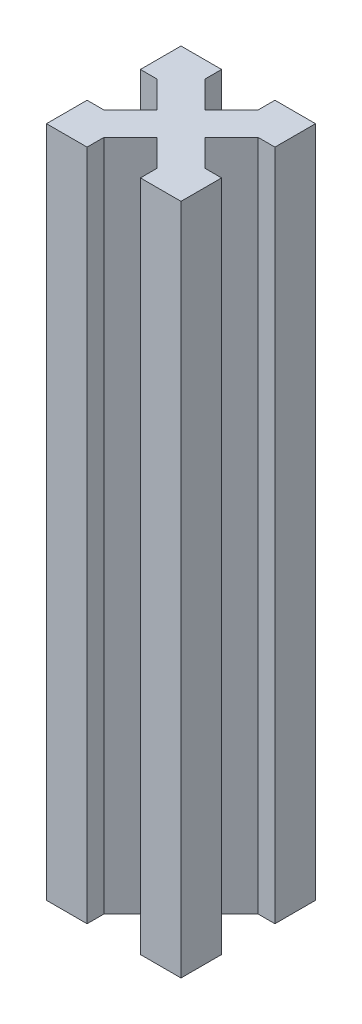
ISO-10303-21;
HEADER;
FILE_DESCRIPTION(('STEP AP214'),'2;1');
FILE_NAME('part.step','',(''),(''),'','','');
FILE_SCHEMA(('AUTOMOTIVE_DESIGN { 1 0 10303 214 1 1 1 1 }'));
ENDSEC;
DATA;
#1=APPLICATION_CONTEXT('core data for automotive mechanical design processes');
#2=APPLICATION_PROTOCOL_DEFINITION('international standard','automotive_design',2000,#1);
#3=PRODUCT_CONTEXT('',#1,'mechanical');
#4=PRODUCT('Part','Part','',(#3));
#5=PRODUCT_RELATED_PRODUCT_CATEGORY('part','',(#4));
#6=PRODUCT_DEFINITION_FORMATION('','',#4);
#7=PRODUCT_DEFINITION_CONTEXT('part definition',#1,'design');
#8=PRODUCT_DEFINITION('design','',#6,#7);
#9=PRODUCT_DEFINITION_SHAPE('','',#8);
#10=(LENGTH_UNIT() NAMED_UNIT(*) SI_UNIT(.MILLI.,.METRE.));
#11=(NAMED_UNIT(*) PLANE_ANGLE_UNIT() SI_UNIT($,.RADIAN.));
#12=(NAMED_UNIT(*) SI_UNIT($,.STERADIAN.) SOLID_ANGLE_UNIT());
#13=UNCERTAINTY_MEASURE_WITH_UNIT(LENGTH_MEASURE(1.E-05),#10,'distance_accuracy_value','');
#14=(GEOMETRIC_REPRESENTATION_CONTEXT(3) GLOBAL_UNCERTAINTY_ASSIGNED_CONTEXT((#13)) GLOBAL_UNIT_ASSIGNED_CONTEXT((#10,
#11,#12)) REPRESENTATION_CONTEXT('',''));
#15=CARTESIAN_POINT('',(0.,0.,0.));
#16=DIRECTION('',(0.,0.,1.));
#17=DIRECTION('',(1.,0.,0.));
#18=AXIS2_PLACEMENT_3D('',#15,#16,#17);
#19=CARTESIAN_POINT('',(-11.7677669529664,100.,-11.7677669529664));
#20=DIRECTION('',(0.707106781186548,0.,0.707106781186547));
#21=DIRECTION('',(0.707106781186547,0.,-0.707106781186548));
#22=AXIS2_PLACEMENT_3D('',#19,#20,#21);
#23=PLANE('',#22);
#24=DIRECTION('',(-0.707106781186547,0.,0.707106781186548));
#25=VECTOR('',#24,1.);
#26=CARTESIAN_POINT('',(-11.7677669529664,0.,-11.7677669529664));
#27=LINE('',#26,#25);
#28=CARTESIAN_POINT('',(-13.5355339059327,0.,-10.));
#29=VERTEX_POINT('',#28);
#30=CARTESIAN_POINT('',(-17.5,0.,-6.03553390593274));
#31=VERTEX_POINT('',#30);
#32=EDGE_CURVE('E228',#29,#31,#27,.T.);
#33=ORIENTED_EDGE('',*,*,#32,.T.);
#34=DIRECTION('',(0.,-1.,0.));
#35=VECTOR('',#34,1.);
#36=CARTESIAN_POINT('',(-17.5,100.,-6.03553390593274));
#37=LINE('',#36,#35);
#38=CARTESIAN_POINT('',(-17.5,100.,-6.03553390593274));
#39=VERTEX_POINT('',#38);
#40=EDGE_CURVE('E11',#39,#31,#37,.T.);
#41=ORIENTED_EDGE('',*,*,#40,.F.);
#42=DIRECTION('',(-0.707106781186547,0.,0.707106781186548));
#43=VECTOR('',#42,1.);
#44=CARTESIAN_POINT('',(-11.7677669529664,100.,-11.7677669529664));
#45=LINE('',#44,#43);
#46=CARTESIAN_POINT('',(-13.5355339059327,100.,-10.));
#47=VERTEX_POINT('',#46);
#48=EDGE_CURVE('E291',#47,#39,#45,.T.);
#49=ORIENTED_EDGE('',*,*,#48,.F.);
#50=DIRECTION('',(0.,-1.,0.));
#51=VECTOR('',#50,1.);
#52=CARTESIAN_POINT('',(-13.5355339059327,100.,-10.));
#53=LINE('',#52,#51);
#54=EDGE_CURVE('E224',#47,#29,#53,.T.);
#55=ORIENTED_EDGE('',*,*,#54,.T.);
#56=EDGE_LOOP('',(#33,#41,#49,#55));
#57=FACE_BOUND('',#56,.T.);
#58=ADVANCED_FACE('F38',(#57),#23,.F.);
#59=CARTESIAN_POINT('',(0.,100.,-6.03553390593273));
#60=DIRECTION('',(0.,0.,1.));
#61=DIRECTION('',(1.,0.,0.));
#62=AXIS2_PLACEMENT_3D('',#59,#60,#61);
#63=PLANE('',#62);
#64=DIRECTION('',(-1.,0.,0.));
#65=VECTOR('',#64,1.);
#66=CARTESIAN_POINT('',(0.,0.,-6.03553390593273));
#67=LINE('',#66,#65);
#68=CARTESIAN_POINT('',(-20.,0.,-6.03553390593273));
#69=VERTEX_POINT('',#68);
#70=EDGE_CURVE('E231',#31,#69,#67,.T.);
#71=ORIENTED_EDGE('',*,*,#70,.T.);
#72=DIRECTION('',(0.,-1.,0.));
#73=VECTOR('',#72,1.);
#74=CARTESIAN_POINT('',(-20.,100.,-6.03553390593273));
#75=LINE('',#74,#73);
#76=CARTESIAN_POINT('',(-20.,100.,-6.03553390593273));
#77=VERTEX_POINT('',#76);
#78=EDGE_CURVE('E46',#77,#69,#75,.T.);
#79=ORIENTED_EDGE('',*,*,#78,.F.);
#80=DIRECTION('',(-1.,0.,0.));
#81=VECTOR('',#80,1.);
#82=CARTESIAN_POINT('',(0.,100.,-6.03553390593273));
#83=LINE('',#82,#81);
#84=EDGE_CURVE('E141',#39,#77,#83,.T.);
#85=ORIENTED_EDGE('',*,*,#84,.F.);
#86=ORIENTED_EDGE('',*,*,#40,.T.);
#87=EDGE_LOOP('',(#71,#79,#85,#86));
#88=FACE_BOUND('',#87,.T.);
#89=ADVANCED_FACE('F340',(#88),#63,.F.);
#90=CARTESIAN_POINT('',(-20.,100.,0.));
#91=DIRECTION('',(-1.,0.,0.));
#92=DIRECTION('',(0.,0.,1.));
#93=AXIS2_PLACEMENT_3D('',#90,#91,#92);
#94=PLANE('',#93);
#95=DIRECTION('',(0.,0.,-1.));
#96=VECTOR('',#95,1.);
#97=CARTESIAN_POINT('',(-20.,0.,0.));
#98=LINE('',#97,#96);
#99=CARTESIAN_POINT('',(-20.,0.,0.));
#100=VERTEX_POINT('',#99);
#101=EDGE_CURVE('E234',#100,#69,#98,.T.);
#102=ORIENTED_EDGE('',*,*,#101,.F.);
#103=DIRECTION('',(0.,-1.,0.));
#104=VECTOR('',#103,1.);
#105=CARTESIAN_POINT('',(-20.,100.,0.));
#106=LINE('',#105,#104);
#107=CARTESIAN_POINT('',(-20.,100.,0.));
#108=VERTEX_POINT('',#107);
#109=EDGE_CURVE('E333',#108,#100,#106,.T.);
#110=ORIENTED_EDGE('',*,*,#109,.F.);
#111=DIRECTION('',(0.,0.,-1.));
#112=VECTOR('',#111,1.);
#113=CARTESIAN_POINT('',(-20.,100.,0.));
#114=LINE('',#113,#112);
#115=EDGE_CURVE('E339',#108,#77,#114,.T.);
#116=ORIENTED_EDGE('',*,*,#115,.T.);
#117=ORIENTED_EDGE('',*,*,#78,.T.);
#118=EDGE_LOOP('',(#102,#110,#116,#117));
#119=FACE_BOUND('',#118,.T.);
#120=ADVANCED_FACE('F337',(#119),#94,.T.);
#121=CARTESIAN_POINT('',(0.,100.,0.));
#122=DIRECTION('',(0.,0.,1.));
#123=DIRECTION('',(1.,0.,0.));
#124=AXIS2_PLACEMENT_3D('',#121,#122,#123);
#125=PLANE('',#124);
#126=DIRECTION('',(-1.,0.,0.));
#127=VECTOR('',#126,1.);
#128=CARTESIAN_POINT('',(0.,0.,0.));
#129=LINE('',#128,#127);
#130=CARTESIAN_POINT('',(-13.9644660940673,0.,0.));
#131=VERTEX_POINT('',#130);
#132=EDGE_CURVE('E237',#131,#100,#129,.T.);
#133=ORIENTED_EDGE('',*,*,#132,.F.);
#134=DIRECTION('',(0.,-1.,0.));
#135=VECTOR('',#134,1.);
#136=CARTESIAN_POINT('',(-13.9644660940673,100.,0.));
#137=LINE('',#136,#135);
#138=CARTESIAN_POINT('',(-13.9644660940673,100.,0.));
#139=VERTEX_POINT('',#138);
#140=EDGE_CURVE('E331',#139,#131,#137,.T.);
#141=ORIENTED_EDGE('',*,*,#140,.F.);
#142=DIRECTION('',(-1.,0.,0.));
#143=VECTOR('',#142,1.);
#144=CARTESIAN_POINT('',(0.,100.,0.));
#145=LINE('',#144,#143);
#146=EDGE_CURVE('E351',#139,#108,#145,.T.);
#147=ORIENTED_EDGE('',*,*,#146,.T.);
#148=ORIENTED_EDGE('',*,*,#109,.T.);
#149=EDGE_LOOP('',(#133,#141,#147,#148));
#150=FACE_BOUND('',#149,.T.);
#151=ADVANCED_FACE('F348',(#150),#125,.T.);
#152=CARTESIAN_POINT('',(-13.9644660940673,100.,0.));
#153=DIRECTION('',(1.,0.,0.));
#154=DIRECTION('',(0.,0.,-1.));
#155=AXIS2_PLACEMENT_3D('',#152,#153,#154);
#156=PLANE('',#155);
#157=DIRECTION('',(0.,0.,1.));
#158=VECTOR('',#157,1.);
#159=CARTESIAN_POINT('',(-13.9644660940673,0.,0.));
#160=LINE('',#159,#158);
#161=CARTESIAN_POINT('',(-13.9644660940673,0.,-2.5));
#162=VERTEX_POINT('',#161);
#163=EDGE_CURVE('E240',#162,#131,#160,.T.);
#164=ORIENTED_EDGE('',*,*,#163,.F.);
#165=DIRECTION('',(0.,-1.,0.));
#166=VECTOR('',#165,1.);
#167=CARTESIAN_POINT('',(-13.9644660940673,100.,-2.5));
#168=LINE('',#167,#166);
#169=CARTESIAN_POINT('',(-13.9644660940673,100.,-2.5));
#170=VERTEX_POINT('',#169);
#171=EDGE_CURVE('E329',#170,#162,#168,.T.);
#172=ORIENTED_EDGE('',*,*,#171,.F.);
#173=DIRECTION('',(0.,0.,1.));
#174=VECTOR('',#173,1.);
#175=CARTESIAN_POINT('',(-13.9644660940673,100.,0.));
#176=LINE('',#175,#174);
#177=EDGE_CURVE('E355',#170,#139,#176,.T.);
#178=ORIENTED_EDGE('',*,*,#177,.T.);
#179=ORIENTED_EDGE('',*,*,#140,.T.);
#180=EDGE_LOOP('',(#164,#172,#178,#179));
#181=FACE_BOUND('',#180,.T.);
#182=ADVANCED_FACE('F429',(#181),#156,.T.);
#183=CARTESIAN_POINT('',(-8.23223304703364,100.,-8.23223304703363));
#184=DIRECTION('',(0.707106781186548,0.,0.707106781186547));
#185=DIRECTION('',(0.707106781186547,0.,-0.707106781186548));
#186=AXIS2_PLACEMENT_3D('',#183,#184,#185);
#187=PLANE('',#186);
#188=DIRECTION('',(-0.707106781186547,0.,0.707106781186548));
#189=VECTOR('',#188,1.);
#190=CARTESIAN_POINT('',(-8.23223304703364,0.,-8.23223304703363));
#191=LINE('',#190,#189);
#192=CARTESIAN_POINT('',(-9.99999999999999,0.,-6.46446609406727));
#193=VERTEX_POINT('',#192);
#194=EDGE_CURVE('E243',#193,#162,#191,.T.);
#195=ORIENTED_EDGE('',*,*,#194,.F.);
#196=DIRECTION('',(0.,-1.,0.));
#197=VECTOR('',#196,1.);
#198=CARTESIAN_POINT('',(-9.99999999999999,100.,-6.46446609406727));
#199=LINE('',#198,#197);
#200=CARTESIAN_POINT('',(-9.99999999999999,100.,-6.46446609406727));
#201=VERTEX_POINT('',#200);
#202=EDGE_CURVE('E327',#201,#193,#199,.T.);
#203=ORIENTED_EDGE('',*,*,#202,.F.);
#204=DIRECTION('',(-0.707106781186547,0.,0.707106781186548));
#205=VECTOR('',#204,1.);
#206=CARTESIAN_POINT('',(-8.23223304703364,100.,-8.23223304703363));
#207=LINE('',#206,#205);
#208=EDGE_CURVE('E361',#201,#170,#207,.T.);
#209=ORIENTED_EDGE('',*,*,#208,.T.);
#210=ORIENTED_EDGE('',*,*,#171,.T.);
#211=EDGE_LOOP('',(#195,#203,#209,#210));
#212=FACE_BOUND('',#211,.T.);
#213=ADVANCED_FACE('F432',(#212),#187,.T.);
#214=CARTESIAN_POINT('',(-1.76776695296636,100.,1.76776695296636));
#215=DIRECTION('',(0.707106781186548,0.,-0.707106781186548));
#216=DIRECTION('',(-0.707106781186548,0.,-0.707106781186548));
#217=AXIS2_PLACEMENT_3D('',#214,#215,#216);
#218=PLANE('',#217);
#219=DIRECTION('',(0.707106781186548,0.,0.707106781186548));
#220=VECTOR('',#219,1.);
#221=CARTESIAN_POINT('',(-1.76776695296636,0.,1.76776695296636));
#222=LINE('',#221,#220);
#223=CARTESIAN_POINT('',(-6.03553390593273,0.,-2.5));
#224=VERTEX_POINT('',#223);
#225=EDGE_CURVE('E246',#193,#224,#222,.T.);
#226=ORIENTED_EDGE('',*,*,#225,.T.);
#227=DIRECTION('',(0.,-1.,0.));
#228=VECTOR('',#227,1.);
#229=CARTESIAN_POINT('',(-6.03553390593273,100.,-2.5));
#230=LINE('',#229,#228);
#231=CARTESIAN_POINT('',(-6.03553390593273,100.,-2.5));
#232=VERTEX_POINT('',#231);
#233=EDGE_CURVE('E324',#232,#224,#230,.T.);
#234=ORIENTED_EDGE('',*,*,#233,.F.);
#235=DIRECTION('',(0.707106781186548,0.,0.707106781186548));
#236=VECTOR('',#235,1.);
#237=CARTESIAN_POINT('',(-1.76776695296636,100.,1.76776695296636));
#238=LINE('',#237,#236);
#239=EDGE_CURVE('E364',#201,#232,#238,.T.);
#240=ORIENTED_EDGE('',*,*,#239,.F.);
#241=ORIENTED_EDGE('',*,*,#202,.T.);
#242=EDGE_LOOP('',(#226,#234,#240,#241));
#243=FACE_BOUND('',#242,.T.);
#244=ADVANCED_FACE('F436',(#243),#218,.F.);
#245=CARTESIAN_POINT('',(-6.03553390593273,100.,0.));
#246=DIRECTION('',(1.,0.,0.));
#247=DIRECTION('',(0.,0.,-1.));
#248=AXIS2_PLACEMENT_3D('',#245,#246,#247);
#249=PLANE('',#248);
#250=DIRECTION('',(0.,0.,1.));
#251=VECTOR('',#250,1.);
#252=CARTESIAN_POINT('',(-6.03553390593273,0.,0.));
#253=LINE('',#252,#251);
#254=CARTESIAN_POINT('',(-6.03553390593273,0.,0.));
#255=VERTEX_POINT('',#254);
#256=EDGE_CURVE('E248',#224,#255,#253,.T.);
#257=ORIENTED_EDGE('',*,*,#256,.T.);
#258=DIRECTION('',(0.,-1.,0.));
#259=VECTOR('',#258,1.);
#260=CARTESIAN_POINT('',(-6.03553390593273,100.,0.));
#261=LINE('',#260,#259);
#262=CARTESIAN_POINT('',(-6.03553390593273,100.,0.));
#263=VERTEX_POINT('',#262);
#264=EDGE_CURVE('E322',#263,#255,#261,.T.);
#265=ORIENTED_EDGE('',*,*,#264,.F.);
#266=DIRECTION('',(0.,0.,1.));
#267=VECTOR('',#266,1.);
#268=CARTESIAN_POINT('',(-6.03553390593273,100.,0.));
#269=LINE('',#268,#267);
#270=EDGE_CURVE('E366',#232,#263,#269,.T.);
#271=ORIENTED_EDGE('',*,*,#270,.F.);
#272=ORIENTED_EDGE('',*,*,#233,.T.);
#273=EDGE_LOOP('',(#257,#265,#271,#272));
#274=FACE_BOUND('',#273,.T.);
#275=ADVANCED_FACE('F440',(#274),#249,.F.);
#276=CARTESIAN_POINT('',(0.,100.,0.));
#277=DIRECTION('',(0.,0.,1.));
#278=DIRECTION('',(1.,0.,0.));
#279=AXIS2_PLACEMENT_3D('',#276,#277,#278);
#280=PLANE('',#279);
#281=DIRECTION('',(-1.,0.,0.));
#282=VECTOR('',#281,1.);
#283=CARTESIAN_POINT('',(0.,0.,0.));
#284=LINE('',#283,#282);
#285=CARTESIAN_POINT('',(0.,0.,0.));
#286=VERTEX_POINT('',#285);
#287=EDGE_CURVE('E251',#286,#255,#284,.T.);
#288=ORIENTED_EDGE('',*,*,#287,.F.);
#289=DIRECTION('',(0.,-1.,0.));
#290=VECTOR('',#289,1.);
#291=CARTESIAN_POINT('',(0.,100.,0.));
#292=LINE('',#291,#290);
#293=CARTESIAN_POINT('',(0.,100.,0.));
#294=VERTEX_POINT('',#293);
#295=EDGE_CURVE('E320',#294,#286,#292,.T.);
#296=ORIENTED_EDGE('',*,*,#295,.F.);
#297=DIRECTION('',(-1.,0.,0.));
#298=VECTOR('',#297,1.);
#299=CARTESIAN_POINT('',(0.,100.,0.));
#300=LINE('',#299,#298);
#301=EDGE_CURVE('E368',#294,#263,#300,.T.);
#302=ORIENTED_EDGE('',*,*,#301,.T.);
#303=ORIENTED_EDGE('',*,*,#264,.T.);
#304=EDGE_LOOP('',(#288,#296,#302,#303));
#305=FACE_BOUND('',#304,.T.);
#306=ADVANCED_FACE('F444',(#305),#280,.T.);
#307=CARTESIAN_POINT('',(0.,100.,0.));
#308=DIRECTION('',(-1.,0.,0.));
#309=DIRECTION('',(0.,0.,1.));
#310=AXIS2_PLACEMENT_3D('',#307,#308,#309);
#311=PLANE('',#310);
#312=DIRECTION('',(0.,0.,-1.));
#313=VECTOR('',#312,1.);
#314=CARTESIAN_POINT('',(0.,0.,0.));
#315=LINE('',#314,#313);
#316=CARTESIAN_POINT('',(0.,0.,-6.03553390593273));
#317=VERTEX_POINT('',#316);
#318=EDGE_CURVE('E254',#286,#317,#315,.T.);
#319=ORIENTED_EDGE('',*,*,#318,.T.);
#320=DIRECTION('',(0.,-1.,0.));
#321=VECTOR('',#320,1.);
#322=CARTESIAN_POINT('',(0.,100.,-6.03553390593273));
#323=LINE('',#322,#321);
#324=CARTESIAN_POINT('',(0.,100.,-6.03553390593273));
#325=VERTEX_POINT('',#324);
#326=EDGE_CURVE('E318',#325,#317,#323,.T.);
#327=ORIENTED_EDGE('',*,*,#326,.F.);
#328=DIRECTION('',(0.,0.,-1.));
#329=VECTOR('',#328,1.);
#330=CARTESIAN_POINT('',(0.,100.,0.));
#331=LINE('',#330,#329);
#332=EDGE_CURVE('E371',#294,#325,#331,.T.);
#333=ORIENTED_EDGE('',*,*,#332,.F.);
#334=ORIENTED_EDGE('',*,*,#295,.T.);
#335=EDGE_LOOP('',(#319,#327,#333,#334));
#336=FACE_BOUND('',#335,.T.);
#337=ADVANCED_FACE('F448',(#336),#311,.F.);
#338=CARTESIAN_POINT('',(0.,100.,-6.03553390593273));
#339=DIRECTION('',(0.,0.,-1.));
#340=DIRECTION('',(-1.,0.,0.));
#341=AXIS2_PLACEMENT_3D('',#338,#339,#340);
#342=PLANE('',#341);
#343=DIRECTION('',(1.,0.,0.));
#344=VECTOR('',#343,1.);
#345=CARTESIAN_POINT('',(0.,0.,-6.03553390593273));
#346=LINE('',#345,#344);
#347=CARTESIAN_POINT('',(-2.5,0.,-6.03553390593274));
#348=VERTEX_POINT('',#347);
#349=EDGE_CURVE('E257',#348,#317,#346,.T.);
#350=ORIENTED_EDGE('',*,*,#349,.F.);
#351=DIRECTION('',(0.,-1.,0.));
#352=VECTOR('',#351,1.);
#353=CARTESIAN_POINT('',(-2.5,100.,-6.03553390593274));
#354=LINE('',#353,#352);
#355=CARTESIAN_POINT('',(-2.5,100.,-6.03553390593274));
#356=VERTEX_POINT('',#355);
#357=EDGE_CURVE('E316',#356,#348,#354,.T.);
#358=ORIENTED_EDGE('',*,*,#357,.F.);
#359=DIRECTION('',(1.,0.,0.));
#360=VECTOR('',#359,1.);
#361=CARTESIAN_POINT('',(0.,100.,-6.03553390593273));
#362=LINE('',#361,#360);
#363=EDGE_CURVE('E373',#356,#325,#362,.T.);
#364=ORIENTED_EDGE('',*,*,#363,.T.);
#365=ORIENTED_EDGE('',*,*,#326,.T.);
#366=EDGE_LOOP('',(#350,#358,#364,#365));
#367=FACE_BOUND('',#366,.T.);
#368=ADVANCED_FACE('F452',(#367),#342,.T.);
#369=CARTESIAN_POINT('',(1.76776695296637,100.,-1.76776695296637));
#370=DIRECTION('',(0.707106781186548,0.,-0.707106781186548));
#371=DIRECTION('',(-0.707106781186548,0.,-0.707106781186548));
#372=AXIS2_PLACEMENT_3D('',#369,#370,#371);
#373=PLANE('',#372);
#374=DIRECTION('',(0.707106781186548,0.,0.707106781186548));
#375=VECTOR('',#374,1.);
#376=CARTESIAN_POINT('',(1.76776695296637,0.,-1.76776695296637));
#377=LINE('',#376,#375);
#378=CARTESIAN_POINT('',(-6.46446609406727,0.,-10.));
#379=VERTEX_POINT('',#378);
#380=EDGE_CURVE('E260',#379,#348,#377,.T.);
#381=ORIENTED_EDGE('',*,*,#380,.F.);
#382=DIRECTION('',(0.,-1.,0.));
#383=VECTOR('',#382,1.);
#384=CARTESIAN_POINT('',(-6.46446609406727,100.,-10.));
#385=LINE('',#384,#383);
#386=CARTESIAN_POINT('',(-6.46446609406727,100.,-10.));
#387=VERTEX_POINT('',#386);
#388=EDGE_CURVE('E314',#387,#379,#385,.T.);
#389=ORIENTED_EDGE('',*,*,#388,.F.);
#390=DIRECTION('',(0.707106781186548,0.,0.707106781186548));
#391=VECTOR('',#390,1.);
#392=CARTESIAN_POINT('',(1.76776695296637,100.,-1.76776695296637));
#393=LINE('',#392,#391);
#394=EDGE_CURVE('E376',#387,#356,#393,.T.);
#395=ORIENTED_EDGE('',*,*,#394,.T.);
#396=ORIENTED_EDGE('',*,*,#357,.T.);
#397=EDGE_LOOP('',(#381,#389,#395,#396));
#398=FACE_BOUND('',#397,.T.);
#399=ADVANCED_FACE('F456',(#398),#373,.T.);
#400=CARTESIAN_POINT('',(-8.23223304703364,100.,-8.23223304703363));
#401=DIRECTION('',(0.707106781186548,0.,0.707106781186547));
#402=DIRECTION('',(0.707106781186547,0.,-0.707106781186548));
#403=AXIS2_PLACEMENT_3D('',#400,#401,#402);
#404=PLANE('',#403);
#405=DIRECTION('',(-0.707106781186547,0.,0.707106781186548));
#406=VECTOR('',#405,1.);
#407=CARTESIAN_POINT('',(-8.23223304703364,0.,-8.23223304703363));
#408=LINE('',#407,#406);
#409=CARTESIAN_POINT('',(-2.50000000000001,0.,-13.9644660940673));
#410=VERTEX_POINT('',#409);
#411=EDGE_CURVE('E263',#410,#379,#408,.T.);
#412=ORIENTED_EDGE('',*,*,#411,.F.);
#413=DIRECTION('',(0.,-1.,0.));
#414=VECTOR('',#413,1.);
#415=CARTESIAN_POINT('',(-2.50000000000001,100.,-13.9644660940673));
#416=LINE('',#415,#414);
#417=CARTESIAN_POINT('',(-2.50000000000001,100.,-13.9644660940673));
#418=VERTEX_POINT('',#417);
#419=EDGE_CURVE('E312',#418,#410,#416,.T.);
#420=ORIENTED_EDGE('',*,*,#419,.F.);
#421=DIRECTION('',(-0.707106781186547,0.,0.707106781186548));
#422=VECTOR('',#421,1.);
#423=CARTESIAN_POINT('',(-8.23223304703364,100.,-8.23223304703363));
#424=LINE('',#423,#422);
#425=EDGE_CURVE('E379',#418,#387,#424,.T.);
#426=ORIENTED_EDGE('',*,*,#425,.T.);
#427=ORIENTED_EDGE('',*,*,#388,.T.);
#428=EDGE_LOOP('',(#412,#420,#426,#427));
#429=FACE_BOUND('',#428,.T.);
#430=ADVANCED_FACE('F460',(#429),#404,.T.);
#431=CARTESIAN_POINT('',(0.,100.,-13.9644660940673));
#432=DIRECTION('',(0.,0.,-1.));
#433=DIRECTION('',(-1.,0.,0.));
#434=AXIS2_PLACEMENT_3D('',#431,#432,#433);
#435=PLANE('',#434);
#436=DIRECTION('',(1.,0.,0.));
#437=VECTOR('',#436,1.);
#438=CARTESIAN_POINT('',(0.,0.,-13.9644660940673));
#439=LINE('',#438,#437);
#440=CARTESIAN_POINT('',(0.,0.,-13.9644660940673));
#441=VERTEX_POINT('',#440);
#442=EDGE_CURVE('E266',#410,#441,#439,.T.);
#443=ORIENTED_EDGE('',*,*,#442,.T.);
#444=DIRECTION('',(0.,-1.,0.));
#445=VECTOR('',#444,1.);
#446=CARTESIAN_POINT('',(0.,100.,-13.9644660940673));
#447=LINE('',#446,#445);
#448=CARTESIAN_POINT('',(0.,100.,-13.9644660940673));
#449=VERTEX_POINT('',#448);
#450=EDGE_CURVE('E309',#449,#441,#447,.T.);
#451=ORIENTED_EDGE('',*,*,#450,.F.);
#452=DIRECTION('',(1.,0.,0.));
#453=VECTOR('',#452,1.);
#454=CARTESIAN_POINT('',(0.,100.,-13.9644660940673));
#455=LINE('',#454,#453);
#456=EDGE_CURVE('E382',#418,#449,#455,.T.);
#457=ORIENTED_EDGE('',*,*,#456,.F.);
#458=ORIENTED_EDGE('',*,*,#419,.T.);
#459=EDGE_LOOP('',(#443,#451,#457,#458));
#460=FACE_BOUND('',#459,.T.);
#461=ADVANCED_FACE('F464',(#460),#435,.F.);
#462=CARTESIAN_POINT('',(0.,100.,0.));
#463=DIRECTION('',(-1.,0.,0.));
#464=DIRECTION('',(0.,0.,1.));
#465=AXIS2_PLACEMENT_3D('',#462,#463,#464);
#466=PLANE('',#465);
#467=DIRECTION('',(0.,0.,-1.));
#468=VECTOR('',#467,1.);
#469=CARTESIAN_POINT('',(0.,0.,0.));
#470=LINE('',#469,#468);
#471=CARTESIAN_POINT('',(0.,0.,-20.));
#472=VERTEX_POINT('',#471);
#473=EDGE_CURVE('E268',#441,#472,#470,.T.);
#474=ORIENTED_EDGE('',*,*,#473,.T.);
#475=DIRECTION('',(0.,-1.,0.));
#476=VECTOR('',#475,1.);
#477=CARTESIAN_POINT('',(0.,100.,-20.));
#478=LINE('',#477,#476);
#479=CARTESIAN_POINT('',(0.,100.,-20.));
#480=VERTEX_POINT('',#479);
#481=EDGE_CURVE('E306',#480,#472,#478,.T.);
#482=ORIENTED_EDGE('',*,*,#481,.F.);
#483=DIRECTION('',(0.,0.,-1.));
#484=VECTOR('',#483,1.);
#485=CARTESIAN_POINT('',(0.,100.,0.));
#486=LINE('',#485,#484);
#487=EDGE_CURVE('E384',#449,#480,#486,.T.);
#488=ORIENTED_EDGE('',*,*,#487,.F.);
#489=ORIENTED_EDGE('',*,*,#450,.T.);
#490=EDGE_LOOP('',(#474,#482,#488,#489));
#491=FACE_BOUND('',#490,.T.);
#492=ADVANCED_FACE('F468',(#491),#466,.F.);
#493=CARTESIAN_POINT('',(0.,100.,-20.));
#494=DIRECTION('',(0.,0.,1.));
#495=DIRECTION('',(1.,0.,0.));
#496=AXIS2_PLACEMENT_3D('',#493,#494,#495);
#497=PLANE('',#496);
#498=DIRECTION('',(-1.,0.,0.));
#499=VECTOR('',#498,1.);
#500=CARTESIAN_POINT('',(0.,0.,-20.));
#501=LINE('',#500,#499);
#502=CARTESIAN_POINT('',(-6.03553390593273,0.,-20.));
#503=VERTEX_POINT('',#502);
#504=EDGE_CURVE('E270',#472,#503,#501,.T.);
#505=ORIENTED_EDGE('',*,*,#504,.T.);
#506=DIRECTION('',(0.,-1.,0.));
#507=VECTOR('',#506,1.);
#508=CARTESIAN_POINT('',(-6.03553390593273,100.,-20.));
#509=LINE('',#508,#507);
#510=CARTESIAN_POINT('',(-6.03553390593273,100.,-20.));
#511=VERTEX_POINT('',#510);
#512=EDGE_CURVE('E304',#511,#503,#509,.T.);
#513=ORIENTED_EDGE('',*,*,#512,.F.);
#514=DIRECTION('',(-1.,0.,0.));
#515=VECTOR('',#514,1.);
#516=CARTESIAN_POINT('',(0.,100.,-20.));
#517=LINE('',#516,#515);
#518=EDGE_CURVE('E386',#480,#511,#517,.T.);
#519=ORIENTED_EDGE('',*,*,#518,.F.);
#520=ORIENTED_EDGE('',*,*,#481,.T.);
#521=EDGE_LOOP('',(#505,#513,#519,#520));
#522=FACE_BOUND('',#521,.T.);
#523=ADVANCED_FACE('F472',(#522),#497,.F.);
#524=CARTESIAN_POINT('',(-6.03553390593271,100.,0.));
#525=DIRECTION('',(-1.,0.,0.));
#526=DIRECTION('',(0.,0.,1.));
#527=AXIS2_PLACEMENT_3D('',#524,#525,#526);
#528=PLANE('',#527);
#529=DIRECTION('',(0.,0.,-1.));
#530=VECTOR('',#529,1.);
#531=CARTESIAN_POINT('',(-6.03553390593271,0.,0.));
#532=LINE('',#531,#530);
#533=CARTESIAN_POINT('',(-6.03553390593274,0.,-17.5));
#534=VERTEX_POINT('',#533);
#535=EDGE_CURVE('E273',#534,#503,#532,.T.);
#536=ORIENTED_EDGE('',*,*,#535,.F.);
#537=DIRECTION('',(0.,-1.,0.));
#538=VECTOR('',#537,1.);
#539=CARTESIAN_POINT('',(-6.03553390593274,100.,-17.5));
#540=LINE('',#539,#538);
#541=CARTESIAN_POINT('',(-6.03553390593274,100.,-17.5));
#542=VERTEX_POINT('',#541);
#543=EDGE_CURVE('E302',#542,#534,#540,.T.);
#544=ORIENTED_EDGE('',*,*,#543,.F.);
#545=DIRECTION('',(0.,0.,-1.));
#546=VECTOR('',#545,1.);
#547=CARTESIAN_POINT('',(-6.03553390593271,100.,0.));
#548=LINE('',#547,#546);
#549=EDGE_CURVE('E388',#542,#511,#548,.T.);
#550=ORIENTED_EDGE('',*,*,#549,.T.);
#551=ORIENTED_EDGE('',*,*,#512,.T.);
#552=EDGE_LOOP('',(#536,#544,#550,#551));
#553=FACE_BOUND('',#552,.T.);
#554=ADVANCED_FACE('F476',(#553),#528,.T.);
#555=CARTESIAN_POINT('',(-11.7677669529664,100.,-11.7677669529664));
#556=DIRECTION('',(0.707106781186548,0.,0.707106781186547));
#557=DIRECTION('',(0.707106781186547,0.,-0.707106781186548));
#558=AXIS2_PLACEMENT_3D('',#555,#556,#557);
#559=PLANE('',#558);
#560=DIRECTION('',(-0.707106781186547,0.,0.707106781186548));
#561=VECTOR('',#560,1.);
#562=CARTESIAN_POINT('',(-11.7677669529664,0.,-11.7677669529664));
#563=LINE('',#562,#561);
#564=CARTESIAN_POINT('',(-10.,0.,-13.5355339059327));
#565=VERTEX_POINT('',#564);
#566=EDGE_CURVE('E276',#534,#565,#563,.T.);
#567=ORIENTED_EDGE('',*,*,#566,.T.);
#568=DIRECTION('',(0.,-1.,0.));
#569=VECTOR('',#568,1.);
#570=CARTESIAN_POINT('',(-10.,100.,-13.5355339059327));
#571=LINE('',#570,#569);
#572=CARTESIAN_POINT('',(-10.,100.,-13.5355339059327));
#573=VERTEX_POINT('',#572);
#574=EDGE_CURVE('E300',#573,#565,#571,.T.);
#575=ORIENTED_EDGE('',*,*,#574,.F.);
#576=DIRECTION('',(-0.707106781186547,0.,0.707106781186548));
#577=VECTOR('',#576,1.);
#578=CARTESIAN_POINT('',(-11.7677669529664,100.,-11.7677669529664));
#579=LINE('',#578,#577);
#580=EDGE_CURVE('E391',#542,#573,#579,.T.);
#581=ORIENTED_EDGE('',*,*,#580,.F.);
#582=ORIENTED_EDGE('',*,*,#543,.T.);
#583=EDGE_LOOP('',(#567,#575,#581,#582));
#584=FACE_BOUND('',#583,.T.);
#585=ADVANCED_FACE('F480',(#584),#559,.F.);
#586=CARTESIAN_POINT('',(1.76776695296637,100.,-1.76776695296637));
#587=DIRECTION('',(0.707106781186548,0.,-0.707106781186548));
#588=DIRECTION('',(-0.707106781186548,0.,-0.707106781186548));
#589=AXIS2_PLACEMENT_3D('',#586,#587,#588);
#590=PLANE('',#589);
#591=DIRECTION('',(0.707106781186548,0.,0.707106781186548));
#592=VECTOR('',#591,1.);
#593=CARTESIAN_POINT('',(1.76776695296637,0.,-1.76776695296637));
#594=LINE('',#593,#592);
#595=CARTESIAN_POINT('',(-13.9644660940673,0.,-17.5));
#596=VERTEX_POINT('',#595);
#597=EDGE_CURVE('E279',#596,#565,#594,.T.);
#598=ORIENTED_EDGE('',*,*,#597,.F.);
#599=DIRECTION('',(0.,-1.,0.));
#600=VECTOR('',#599,1.);
#601=CARTESIAN_POINT('',(-13.9644660940673,100.,-17.5));
#602=LINE('',#601,#600);
#603=CARTESIAN_POINT('',(-13.9644660940673,100.,-17.5));
#604=VERTEX_POINT('',#603);
#605=EDGE_CURVE('E298',#604,#596,#602,.T.);
#606=ORIENTED_EDGE('',*,*,#605,.F.);
#607=DIRECTION('',(0.707106781186548,0.,0.707106781186548));
#608=VECTOR('',#607,1.);
#609=CARTESIAN_POINT('',(1.76776695296637,100.,-1.76776695296637));
#610=LINE('',#609,#608);
#611=EDGE_CURVE('E393',#604,#573,#610,.T.);
#612=ORIENTED_EDGE('',*,*,#611,.T.);
#613=ORIENTED_EDGE('',*,*,#574,.T.);
#614=EDGE_LOOP('',(#598,#606,#612,#613));
#615=FACE_BOUND('',#614,.T.);
#616=ADVANCED_FACE('F484',(#615),#590,.T.);
#617=CARTESIAN_POINT('',(-13.9644660940673,100.,0.));
#618=DIRECTION('',(-1.,0.,0.));
#619=DIRECTION('',(0.,0.,1.));
#620=AXIS2_PLACEMENT_3D('',#617,#618,#619);
#621=PLANE('',#620);
#622=DIRECTION('',(0.,0.,-1.));
#623=VECTOR('',#622,1.);
#624=CARTESIAN_POINT('',(-13.9644660940673,0.,0.));
#625=LINE('',#624,#623);
#626=CARTESIAN_POINT('',(-13.9644660940673,0.,-20.));
#627=VERTEX_POINT('',#626);
#628=EDGE_CURVE('E282',#596,#627,#625,.T.);
#629=ORIENTED_EDGE('',*,*,#628,.T.);
#630=DIRECTION('',(0.,-1.,0.));
#631=VECTOR('',#630,1.);
#632=CARTESIAN_POINT('',(-13.9644660940673,100.,-20.));
#633=LINE('',#632,#631);
#634=CARTESIAN_POINT('',(-13.9644660940673,100.,-20.));
#635=VERTEX_POINT('',#634);
#636=EDGE_CURVE('E295',#635,#627,#633,.T.);
#637=ORIENTED_EDGE('',*,*,#636,.F.);
#638=DIRECTION('',(0.,0.,-1.));
#639=VECTOR('',#638,1.);
#640=CARTESIAN_POINT('',(-13.9644660940673,100.,0.));
#641=LINE('',#640,#639);
#642=EDGE_CURVE('E396',#604,#635,#641,.T.);
#643=ORIENTED_EDGE('',*,*,#642,.F.);
#644=ORIENTED_EDGE('',*,*,#605,.T.);
#645=EDGE_LOOP('',(#629,#637,#643,#644));
#646=FACE_BOUND('',#645,.T.);
#647=ADVANCED_FACE('F401',(#646),#621,.F.);
#648=CARTESIAN_POINT('',(0.,100.,-20.));
#649=DIRECTION('',(0.,0.,1.));
#650=DIRECTION('',(1.,0.,0.));
#651=AXIS2_PLACEMENT_3D('',#648,#649,#650);
#652=PLANE('',#651);
#653=DIRECTION('',(-1.,0.,0.));
#654=VECTOR('',#653,1.);
#655=CARTESIAN_POINT('',(0.,0.,-20.));
#656=LINE('',#655,#654);
#657=CARTESIAN_POINT('',(-20.,0.,-20.));
#658=VERTEX_POINT('',#657);
#659=EDGE_CURVE('E284',#627,#658,#656,.T.);
#660=ORIENTED_EDGE('',*,*,#659,.T.);
#661=DIRECTION('',(0.,-1.,0.));
#662=VECTOR('',#661,1.);
#663=CARTESIAN_POINT('',(-20.,100.,-20.));
#664=LINE('',#663,#662);
#665=CARTESIAN_POINT('',(-20.,100.,-20.));
#666=VERTEX_POINT('',#665);
#667=EDGE_CURVE('E214',#666,#658,#664,.T.);
#668=ORIENTED_EDGE('',*,*,#667,.F.);
#669=DIRECTION('',(-1.,0.,0.));
#670=VECTOR('',#669,1.);
#671=CARTESIAN_POINT('',(0.,100.,-20.));
#672=LINE('',#671,#670);
#673=EDGE_CURVE('E219',#635,#666,#672,.T.);
#674=ORIENTED_EDGE('',*,*,#673,.F.);
#675=ORIENTED_EDGE('',*,*,#636,.T.);
#676=EDGE_LOOP('',(#660,#668,#674,#675));
#677=FACE_BOUND('',#676,.T.);
#678=ADVANCED_FACE('F405',(#677),#652,.F.);
#679=CARTESIAN_POINT('',(-20.,100.,0.));
#680=DIRECTION('',(-1.,0.,0.));
#681=DIRECTION('',(0.,0.,1.));
#682=AXIS2_PLACEMENT_3D('',#679,#680,#681);
#683=PLANE('',#682);
#684=DIRECTION('',(0.,0.,-1.));
#685=VECTOR('',#684,1.);
#686=CARTESIAN_POINT('',(-20.,0.,0.));
#687=LINE('',#686,#685);
#688=CARTESIAN_POINT('',(-20.,0.,-13.9644660940673));
#689=VERTEX_POINT('',#688);
#690=EDGE_CURVE('E209',#689,#658,#687,.T.);
#691=ORIENTED_EDGE('',*,*,#690,.F.);
#692=DIRECTION('',(0.,-1.,0.));
#693=VECTOR('',#692,1.);
#694=CARTESIAN_POINT('',(-20.,100.,-13.9644660940673));
#695=LINE('',#694,#693);
#696=CARTESIAN_POINT('',(-20.,100.,-13.9644660940673));
#697=VERTEX_POINT('',#696);
#698=EDGE_CURVE('E204',#697,#689,#695,.T.);
#699=ORIENTED_EDGE('',*,*,#698,.F.);
#700=DIRECTION('',(0.,0.,-1.));
#701=VECTOR('',#700,1.);
#702=CARTESIAN_POINT('',(-20.,100.,0.));
#703=LINE('',#702,#701);
#704=EDGE_CURVE('E207',#697,#666,#703,.T.);
#705=ORIENTED_EDGE('',*,*,#704,.T.);
#706=ORIENTED_EDGE('',*,*,#667,.T.);
#707=EDGE_LOOP('',(#691,#699,#705,#706));
#708=FACE_BOUND('',#707,.T.);
#709=ADVANCED_FACE('F206',(#708),#683,.T.);
#710=CARTESIAN_POINT('',(0.,100.,-13.9644660940673));
#711=DIRECTION('',(0.,0.,1.));
#712=DIRECTION('',(1.,0.,0.));
#713=AXIS2_PLACEMENT_3D('',#710,#711,#712);
#714=PLANE('',#713);
#715=DIRECTION('',(-1.,0.,0.));
#716=VECTOR('',#715,1.);
#717=CARTESIAN_POINT('',(0.,0.,-13.9644660940673));
#718=LINE('',#717,#716);
#719=CARTESIAN_POINT('',(-17.5,0.,-13.9644660940673));
#720=VERTEX_POINT('',#719);
#721=EDGE_CURVE('E288',#720,#689,#718,.T.);
#722=ORIENTED_EDGE('',*,*,#721,.F.);
#723=DIRECTION('',(0.,-1.,0.));
#724=VECTOR('',#723,1.);
#725=CARTESIAN_POINT('',(-17.5,100.,-13.9644660940673));
#726=LINE('',#725,#724);
#727=CARTESIAN_POINT('',(-17.5,100.,-13.9644660940673));
#728=VERTEX_POINT('',#727);
#729=EDGE_CURVE('E130',#728,#720,#726,.T.);
#730=ORIENTED_EDGE('',*,*,#729,.F.);
#731=DIRECTION('',(-1.,0.,0.));
#732=VECTOR('',#731,1.);
#733=CARTESIAN_POINT('',(0.,100.,-13.9644660940673));
#734=LINE('',#733,#732);
#735=EDGE_CURVE('E217',#728,#697,#734,.T.);
#736=ORIENTED_EDGE('',*,*,#735,.T.);
#737=ORIENTED_EDGE('',*,*,#698,.T.);
#738=EDGE_LOOP('',(#722,#730,#736,#737));
#739=FACE_BOUND('',#738,.T.);
#740=ADVANCED_FACE('F222',(#739),#714,.T.);
#741=CARTESIAN_POINT('',(-1.76776695296636,100.,1.76776695296636));
#742=DIRECTION('',(0.707106781186548,0.,-0.707106781186548));
#743=DIRECTION('',(-0.707106781186548,0.,-0.707106781186548));
#744=AXIS2_PLACEMENT_3D('',#741,#742,#743);
#745=PLANE('',#744);
#746=DIRECTION('',(0.707106781186548,0.,0.707106781186548));
#747=VECTOR('',#746,1.);
#748=CARTESIAN_POINT('',(-1.76776695296636,0.,1.76776695296636));
#749=LINE('',#748,#747);
#750=EDGE_CURVE('E133',#720,#29,#749,.T.);
#751=ORIENTED_EDGE('',*,*,#750,.T.);
#752=ORIENTED_EDGE('',*,*,#54,.F.);
#753=DIRECTION('',(0.707106781186548,0.,0.707106781186548));
#754=VECTOR('',#753,1.);
#755=CARTESIAN_POINT('',(-1.76776695296636,100.,1.76776695296636));
#756=LINE('',#755,#754);
#757=EDGE_CURVE('E54',#728,#47,#756,.T.);
#758=ORIENTED_EDGE('',*,*,#757,.F.);
#759=ORIENTED_EDGE('',*,*,#729,.T.);
#760=EDGE_LOOP('',(#751,#752,#758,#759));
#761=FACE_BOUND('',#760,.T.);
#762=ADVANCED_FACE('F408',(#761),#745,.F.);
#763=CARTESIAN_POINT('',(0.,100.,0.));
#764=DIRECTION('',(0.,1.,0.));
#765=DIRECTION('',(0.,0.,1.));
#766=AXIS2_PLACEMENT_3D('',#763,#764,#765);
#767=PLANE('',#766);
#768=ORIENTED_EDGE('',*,*,#48,.T.);
#769=ORIENTED_EDGE('',*,*,#84,.T.);
#770=ORIENTED_EDGE('',*,*,#115,.F.);
#771=ORIENTED_EDGE('',*,*,#146,.F.);
#772=ORIENTED_EDGE('',*,*,#177,.F.);
#773=ORIENTED_EDGE('',*,*,#208,.F.);
#774=ORIENTED_EDGE('',*,*,#239,.T.);
#775=ORIENTED_EDGE('',*,*,#270,.T.);
#776=ORIENTED_EDGE('',*,*,#301,.F.);
#777=ORIENTED_EDGE('',*,*,#332,.T.);
#778=ORIENTED_EDGE('',*,*,#363,.F.);
#779=ORIENTED_EDGE('',*,*,#394,.F.);
#780=ORIENTED_EDGE('',*,*,#425,.F.);
#781=ORIENTED_EDGE('',*,*,#456,.T.);
#782=ORIENTED_EDGE('',*,*,#487,.T.);
#783=ORIENTED_EDGE('',*,*,#518,.T.);
#784=ORIENTED_EDGE('',*,*,#549,.F.);
#785=ORIENTED_EDGE('',*,*,#580,.T.);
#786=ORIENTED_EDGE('',*,*,#611,.F.);
#787=ORIENTED_EDGE('',*,*,#642,.T.);
#788=ORIENTED_EDGE('',*,*,#673,.T.);
#789=ORIENTED_EDGE('',*,*,#704,.F.);
#790=ORIENTED_EDGE('',*,*,#735,.F.);
#791=ORIENTED_EDGE('',*,*,#757,.T.);
#792=EDGE_LOOP('',(#768,#769,#770,#771,#772,#773,#774,#775,#776,#777,#778,#779,#780,#781,#782,
#783,#784,#785,#786,#787,#788,#789,#790,#791));
#793=FACE_BOUND('',#792,.T.);
#794=ADVANCED_FACE('F216',(#793),#767,.T.);
#795=CARTESIAN_POINT('',(0.,0.,0.));
#796=DIRECTION('',(0.,1.,0.));
#797=DIRECTION('',(0.,0.,1.));
#798=AXIS2_PLACEMENT_3D('',#795,#796,#797);
#799=PLANE('',#798);
#800=ORIENTED_EDGE('',*,*,#32,.F.);
#801=ORIENTED_EDGE('',*,*,#750,.F.);
#802=ORIENTED_EDGE('',*,*,#721,.T.);
#803=ORIENTED_EDGE('',*,*,#690,.T.);
#804=ORIENTED_EDGE('',*,*,#659,.F.);
#805=ORIENTED_EDGE('',*,*,#628,.F.);
#806=ORIENTED_EDGE('',*,*,#597,.T.);
#807=ORIENTED_EDGE('',*,*,#566,.F.);
#808=ORIENTED_EDGE('',*,*,#535,.T.);
#809=ORIENTED_EDGE('',*,*,#504,.F.);
#810=ORIENTED_EDGE('',*,*,#473,.F.);
#811=ORIENTED_EDGE('',*,*,#442,.F.);
#812=ORIENTED_EDGE('',*,*,#411,.T.);
#813=ORIENTED_EDGE('',*,*,#380,.T.);
#814=ORIENTED_EDGE('',*,*,#349,.T.);
#815=ORIENTED_EDGE('',*,*,#318,.F.);
#816=ORIENTED_EDGE('',*,*,#287,.T.);
#817=ORIENTED_EDGE('',*,*,#256,.F.);
#818=ORIENTED_EDGE('',*,*,#225,.F.);
#819=ORIENTED_EDGE('',*,*,#194,.T.);
#820=ORIENTED_EDGE('',*,*,#163,.T.);
#821=ORIENTED_EDGE('',*,*,#132,.T.);
#822=ORIENTED_EDGE('',*,*,#101,.T.);
#823=ORIENTED_EDGE('',*,*,#70,.F.);
#824=EDGE_LOOP('',(#800,#801,#802,#803,#804,#805,#806,#807,#808,#809,#810,#811,#812,#813,#814,
#815,#816,#817,#818,#819,#820,#821,#822,#823));
#825=FACE_BOUND('',#824,.T.);
#826=ADVANCED_FACE('F344',(#825),#799,.F.);
#827=CLOSED_SHELL('',(#58,#89,#120,#151,#182,#213,#244,#275,#306,#337,#368,#399,#430,#461,#492,
#523,#554,#585,#616,#647,#678,#709,#740,#762,#794,#826));
#828=MANIFOLD_SOLID_BREP('B2',#827);
#829=ADVANCED_BREP_SHAPE_REPRESENTATION('',(#18,#828),#14);
#830=SHAPE_DEFINITION_REPRESENTATION(#9,#829);
ENDSEC;
END-ISO-10303-21;
